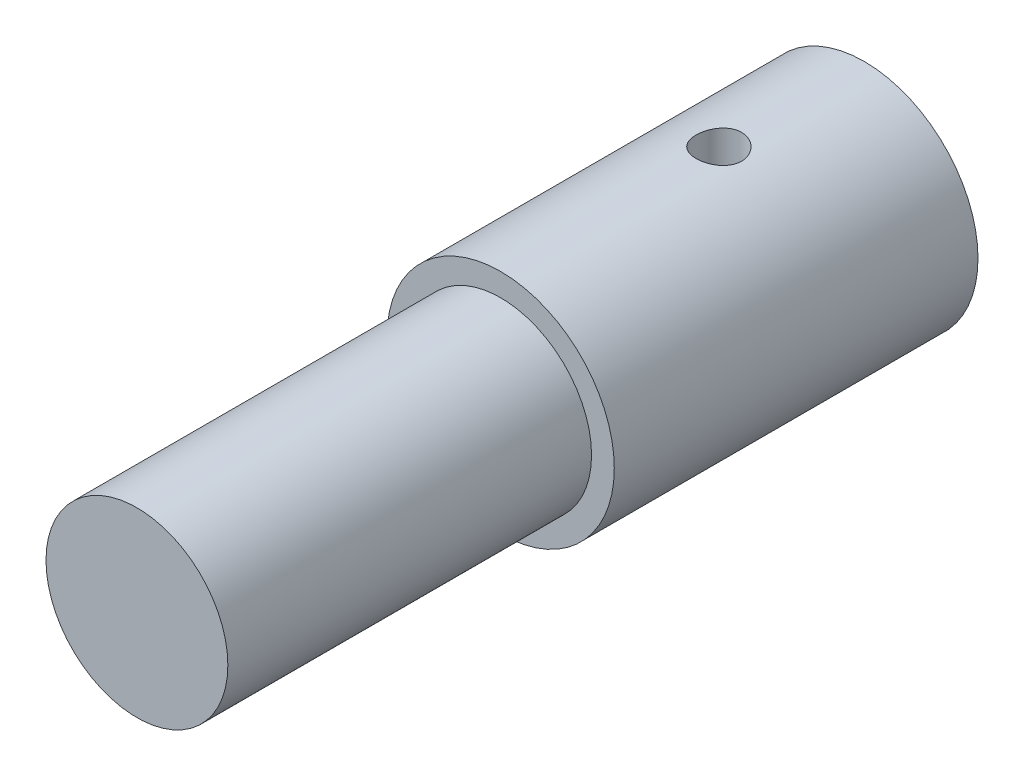
ISO-10303-21;
HEADER;
FILE_DESCRIPTION(('STEP AP214'),'2;1');
FILE_NAME('part.step','',(''),(''),'','','');
FILE_SCHEMA(('AUTOMOTIVE_DESIGN { 1 0 10303 214 1 1 1 1 }'));
ENDSEC;
DATA;
#1=APPLICATION_CONTEXT('core data for automotive mechanical design processes');
#2=APPLICATION_PROTOCOL_DEFINITION('international standard','automotive_design',2000,#1);
#3=PRODUCT_CONTEXT('',#1,'mechanical');
#4=PRODUCT('Part','Part','',(#3));
#5=PRODUCT_RELATED_PRODUCT_CATEGORY('part','',(#4));
#6=PRODUCT_DEFINITION_FORMATION('','',#4);
#7=PRODUCT_DEFINITION_CONTEXT('part definition',#1,'design');
#8=PRODUCT_DEFINITION('design','',#6,#7);
#9=PRODUCT_DEFINITION_SHAPE('','',#8);
#10=(LENGTH_UNIT() NAMED_UNIT(*) SI_UNIT(.MILLI.,.METRE.));
#11=(NAMED_UNIT(*) PLANE_ANGLE_UNIT() SI_UNIT($,.RADIAN.));
#12=(NAMED_UNIT(*) SI_UNIT($,.STERADIAN.) SOLID_ANGLE_UNIT());
#13=UNCERTAINTY_MEASURE_WITH_UNIT(LENGTH_MEASURE(1.E-05),#10,'distance_accuracy_value','');
#14=(GEOMETRIC_REPRESENTATION_CONTEXT(3) GLOBAL_UNCERTAINTY_ASSIGNED_CONTEXT((#13)) GLOBAL_UNIT_ASSIGNED_CONTEXT((#10,
#11,#12)) REPRESENTATION_CONTEXT('',''));
#15=CARTESIAN_POINT('',(0.,0.,0.));
#16=DIRECTION('',(0.,0.,1.));
#17=DIRECTION('',(1.,0.,0.));
#18=AXIS2_PLACEMENT_3D('',#15,#16,#17);
#19=CARTESIAN_POINT('',(0.,0.,-12.7));
#20=DIRECTION('',(0.,0.,1.));
#21=DIRECTION('',(1.,0.,0.));
#22=AXIS2_PLACEMENT_3D('',#19,#20,#21);
#23=CYLINDRICAL_SURFACE('',#22,3.96875);
#24=CARTESIAN_POINT('',(0.,0.,-12.7));
#25=DIRECTION('',(0.,0.,-1.));
#26=DIRECTION('',(-1.,0.,0.));
#27=AXIS2_PLACEMENT_3D('',#24,#25,#26);
#28=CIRCLE('',#27,3.96875);
#29=CARTESIAN_POINT('',(-3.96875,0.,-12.7));
#30=VERTEX_POINT('',#29);
#31=EDGE_CURVE('E52',#30,#30,#28,.T.);
#32=ORIENTED_EDGE('',*,*,#31,.F.);
#33=EDGE_LOOP('',(#32));
#34=FACE_BOUND('',#33,.T.);
#35=CARTESIAN_POINT('',(0.,0.,0.));
#36=DIRECTION('',(0.,0.,-1.));
#37=DIRECTION('',(-1.,0.,0.));
#38=AXIS2_PLACEMENT_3D('',#35,#36,#37);
#39=CIRCLE('',#38,3.96875);
#40=CARTESIAN_POINT('',(-3.96875,0.,0.));
#41=VERTEX_POINT('',#40);
#42=EDGE_CURVE('E55',#41,#41,#39,.T.);
#43=ORIENTED_EDGE('',*,*,#42,.T.);
#44=EDGE_LOOP('',(#43));
#45=FACE_BOUND('',#44,.T.);
#46=CARTESIAN_POINT('',(0.,3.96875,-8.41375));
#47=CARTESIAN_POINT('',(-0.0441141697666526,3.96874918704816,-8.41374837717944));
#48=CARTESIAN_POINT('',(-0.0882488552849584,3.96800693235221,-8.41005998089443));
#49=CARTESIAN_POINT('',(-0.175270721728159,3.9651175271344,-8.39541556553352));
#50=CARTESIAN_POINT('',(-0.218156883298451,3.96296926051523,-8.3844537727138));
#51=CARTESIAN_POINT('',(-0.301410929802754,3.9575077161464,-8.3556147390635));
#52=CARTESIAN_POINT('',(-0.341781183921925,3.95419555454645,-8.33774412200453));
#53=CARTESIAN_POINT('',(-0.418947591160979,3.94676628440531,-8.29561440353791));
#54=CARTESIAN_POINT('',(-0.455743956966425,3.94264922380842,-8.27135568261178));
#55=CARTESIAN_POINT('',(-0.525219197618673,3.93400093730664,-8.21679007015617));
#56=CARTESIAN_POINT('',(-0.557842698732078,3.92946529244076,-8.18641336790823));
#57=CARTESIAN_POINT('',(-0.617566675557621,3.92052318234242,-8.12062414448908));
#58=CARTESIAN_POINT('',(-0.644666719911524,3.91611672722211,-8.08521123037775));
#59=CARTESIAN_POINT('',(-0.692810204219673,3.90788875688763,-8.00995652179682));
#60=CARTESIAN_POINT('',(-0.713796307724781,3.90407292720926,-7.97007737023664));
#61=CARTESIAN_POINT('',(-0.748748872848119,3.89752100271369,-7.88727005616551));
#62=CARTESIAN_POINT('',(-0.762716027934557,3.89478480123557,-7.84434219534384));
#63=CARTESIAN_POINT('',(-0.783054456783581,3.89074664168937,-7.75725178614809));
#64=CARTESIAN_POINT('',(-0.789522882754779,3.8894263564758,-7.71311279308711));
#65=CARTESIAN_POINT('',(-0.794982001382606,3.88831435204373,-7.62435782929205));
#66=CARTESIAN_POINT('',(-0.79397345865384,3.88852247652599,-7.57974190779589));
#67=CARTESIAN_POINT('',(-0.784585817399568,3.89042712473872,-7.49201036200833));
#68=CARTESIAN_POINT('',(-0.776318091318599,3.89210115706644,-7.44888225928332));
#69=CARTESIAN_POINT('',(-0.752822570919546,3.89671358514501,-7.36463786414874));
#70=CARTESIAN_POINT('',(-0.737594444211165,3.89965204127737,-7.32352166792054));
#71=CARTESIAN_POINT('',(-0.700504047041808,3.90648522184699,-7.24414726102277));
#72=CARTESIAN_POINT('',(-0.67859763254049,3.91038627539628,-7.20591024559197));
#73=CARTESIAN_POINT('',(-0.628803649817063,3.91870103651118,-7.13361313783408));
#74=CARTESIAN_POINT('',(-0.600915394208232,3.92311480296703,-7.09955352624939));
#75=CARTESIAN_POINT('',(-0.539353073057463,3.9320551061041,-7.03593541179981));
#76=CARTESIAN_POINT('',(-0.505583952962378,3.93658224311156,-7.00646889926182));
#77=CARTESIAN_POINT('',(-0.43353436284922,3.94516648667062,-6.9536041344984));
#78=CARTESIAN_POINT('',(-0.39525383498239,3.94922358719373,-6.93020596009822));
#79=CARTESIAN_POINT('',(-0.315165888335143,3.95642060315204,-6.89012503955188));
#80=CARTESIAN_POINT('',(-0.273353069295832,3.95955908023316,-6.87345280941965));
#81=CARTESIAN_POINT('',(-0.187443250056127,3.96455430884112,-6.84739512373189));
#82=CARTESIAN_POINT('',(-0.143346527245007,3.96641121562922,-6.83800878547906));
#83=CARTESIAN_POINT('',(-0.0549111532165507,3.96861245794326,-6.82691956480079));
#84=CARTESIAN_POINT('',(-0.0105888856084261,3.96898157380398,-6.82509079198991));
#85=CARTESIAN_POINT('',(0.0777279165154668,3.96823447469519,-6.82882957553536));
#86=CARTESIAN_POINT('',(0.121722469314761,3.96711834322273,-6.83439671611112));
#87=CARTESIAN_POINT('',(0.207728867582567,3.96354166656364,-6.85266470900052));
#88=CARTESIAN_POINT('',(0.249754983994798,3.96109330020839,-6.86530096687021));
#89=CARTESIAN_POINT('',(0.331091879327861,3.95512569448445,-6.89727791123305));
#90=CARTESIAN_POINT('',(0.370402454549797,3.95160637488792,-6.91661910002474));
#91=CARTESIAN_POINT('',(0.445723306613435,3.94382554779552,-6.96172922695448));
#92=CARTESIAN_POINT('',(0.481687288109549,3.9395554815941,-6.98757395744966));
#93=CARTESIAN_POINT('',(0.54881305267587,3.93076695771219,-7.04485604552078));
#94=CARTESIAN_POINT('',(0.579974320213793,3.92624847343658,-7.07629400270489));
#95=CARTESIAN_POINT('',(0.637095968927002,3.91738884698341,-7.14444322306358));
#96=CARTESIAN_POINT('',(0.662969926318619,3.91305145310185,-7.18122749697569));
#97=CARTESIAN_POINT('',(0.708172177165644,3.90512452238229,-7.25869401807686));
#98=CARTESIAN_POINT('',(0.727500732513803,3.90153495562466,-7.29937610922401));
#99=CARTESIAN_POINT('',(0.75894552425568,3.89554037838854,-7.3832785453812));
#100=CARTESIAN_POINT('',(0.771099152959146,3.89312923804798,-7.42648441771069));
#101=CARTESIAN_POINT('',(0.787962492229086,3.8897515295367,-7.51437842870841));
#102=CARTESIAN_POINT('',(0.792673173528682,3.8887847729857,-7.55906637330367));
#103=CARTESIAN_POINT('',(0.794480973001052,3.88841575019907,-7.64778828623205));
#104=CARTESIAN_POINT('',(0.791714656781273,3.88898542106508,-7.69181941196081));
#105=CARTESIAN_POINT('',(0.778948391379423,3.89156236453412,-7.77877512211211));
#106=CARTESIAN_POINT('',(0.76894850030263,3.89356962558941,-7.82169971542025));
#107=CARTESIAN_POINT('',(0.742059863746044,3.89878303473957,-7.90513699579718));
#108=CARTESIAN_POINT('',(0.725187864706891,3.90198626683697,-7.94565527364879));
#109=CARTESIAN_POINT('',(0.685049624152523,3.90923236260748,-8.02330732833296));
#110=CARTESIAN_POINT('',(0.661782846465062,3.91327529667872,-8.06044082101933));
#111=CARTESIAN_POINT('',(0.609049069861716,3.9218311241531,-8.13094923539431));
#112=CARTESIAN_POINT('',(0.579483447992924,3.92635083497074,-8.16424958243115));
#113=CARTESIAN_POINT('',(0.515194842904181,3.93530202485864,-8.22546155063878));
#114=CARTESIAN_POINT('',(0.48047067605296,3.93973348341403,-8.25337193168933));
#115=CARTESIAN_POINT('',(0.406413993088796,3.94806354457952,-8.30328749863249));
#116=CARTESIAN_POINT('',(0.367037052016182,3.95195608530277,-8.32522782760352));
#117=CARTESIAN_POINT('',(0.285088298996706,3.95871005536219,-8.36214523481105));
#118=CARTESIAN_POINT('',(0.242519407060106,3.96157241353776,-8.37712858919141));
#119=CARTESIAN_POINT('',(0.166545806833249,3.96538745747575,-8.39680498376049));
#120=CARTESIAN_POINT('',(0.133573570810941,3.96664103132021,-8.40314803500553));
#121=CARTESIAN_POINT('',(0.0670714981354904,3.9683225984854,-8.41162109293445));
#122=CARTESIAN_POINT('',(0.0335416792879663,3.96875061811817,-8.41375123389213));
#123=CARTESIAN_POINT('',(0.,3.96875,-8.41375));
#124=B_SPLINE_CURVE_WITH_KNOTS('',3,(#46,#47,#48,#49,#50,#51,#52,#53,#54,#55,#56,#57,#58,#59,
#60,#61,#62,#63,#64,#65,#66,#67,#68,#69,#70,#71,#72,#73,#74,#75,#76,#77,#78,#79,#80,#81,#82,#83,
#84,#85,#86,#87,#88,#89,#90,#91,#92,#93,#94,#95,#96,#97,#98,#99,#100,#101,#102,#103,#104,#105,
#106,#107,#108,#109,#110,#111,#112,#113,#114,#115,#116,#117,#118,#119,#120,#121,#122,#123),
.UNSPECIFIED.,.T.,.F.,(4,2,2,2,2,2,2,2,2,2,2,2,2,2,2,2,2,2,2,2,2,2,2,2,2,2,2,2,2,2,2,2,2,2,2,2,
2,2,4),(0.,0.132219803712374,0.264544691486237,0.396743027354958,0.528933491145748,
0.662727806901547,0.796532567418222,0.931554485359512,1.06656306058625,1.19980221925972,
1.33302775273222,1.46424433311233,1.59546718032648,1.72757695349102,1.85970191582551,
1.99420362915009,2.12870706734732,2.26341999415381,2.39811659772816,2.53056021443035,
2.66299638578432,2.79424172823387,2.92549690502718,3.05835896163978,3.19123526999582,
3.3261349893476,3.46102931049251,3.59521427444724,3.72938173612266,3.86111529788113,
3.99284780147258,4.12426119244656,4.25568560518106,4.38934285514819,4.52303082035513,
4.65811787986286,4.7930828344203,4.89361777886353,4.99414951900728),.UNSPECIFIED.);
#125=CARTESIAN_POINT('',(0.,3.96875,-8.41375));
#126=VERTEX_POINT('',#125);
#127=EDGE_CURVE('E64',#126,#126,#124,.T.);
#128=ORIENTED_EDGE('',*,*,#127,.F.);
#129=EDGE_LOOP('',(#128));
#130=FACE_BOUND('',#129,.T.);
#131=ADVANCED_FACE('F35',(#34,#45,#130),#23,.T.);
#132=CARTESIAN_POINT('',(0.,0.,-3.81));
#133=DIRECTION('',(0.,0.,-1.));
#134=DIRECTION('',(-1.,0.,0.));
#135=AXIS2_PLACEMENT_3D('',#132,#133,#134);
#136=CYLINDRICAL_SURFACE('',#135,1.5875);
#137=CARTESIAN_POINT('',(0.,0.,-12.7));
#138=DIRECTION('',(0.,0.,-1.));
#139=DIRECTION('',(-1.,0.,0.));
#140=AXIS2_PLACEMENT_3D('',#137,#138,#139);
#141=CIRCLE('',#140,1.5875);
#142=CARTESIAN_POINT('',(-1.5875,0.,-12.7));
#143=VERTEX_POINT('',#142);
#144=EDGE_CURVE('E61',#143,#143,#141,.T.);
#145=ORIENTED_EDGE('',*,*,#144,.T.);
#146=EDGE_LOOP('',(#145));
#147=FACE_BOUND('',#146,.T.);
#148=CARTESIAN_POINT('',(0.,0.,-3.81));
#149=DIRECTION('',(0.,0.,-1.));
#150=DIRECTION('',(-1.,0.,0.));
#151=AXIS2_PLACEMENT_3D('',#148,#149,#150);
#152=CIRCLE('',#151,1.5875);
#153=CARTESIAN_POINT('',(-1.5875,0.,-3.81));
#154=VERTEX_POINT('',#153);
#155=EDGE_CURVE('E58',#154,#154,#152,.T.);
#156=ORIENTED_EDGE('',*,*,#155,.F.);
#157=EDGE_LOOP('',(#156));
#158=FACE_BOUND('',#157,.T.);
#159=CARTESIAN_POINT('',(0.,1.5875,-8.41375));
#160=CARTESIAN_POINT('',(0.041728995593933,1.58749772514545,-8.4137473787839));
#161=CARTESIAN_POINT('',(0.0835077385103133,1.58583702246742,-8.41044000445967));
#162=CARTESIAN_POINT('',(0.165830436744312,1.57935736354683,-8.3973567762294));
#163=CARTESIAN_POINT('',(0.206371893828843,1.57453240964256,-8.38756863805811));
#164=CARTESIAN_POINT('',(0.284903501248956,1.56222921776379,-8.36200241441042));
#165=CARTESIAN_POINT('',(0.322902899832974,1.55476129847157,-8.34624760750314));
#166=CARTESIAN_POINT('',(0.395662639590211,1.53785710109399,-8.30931581929158));
#167=CARTESIAN_POINT('',(0.430423235854602,1.52842097821614,-8.28813926550247));
#168=CARTESIAN_POINT('',(0.498084330348523,1.50777779992333,-8.23950818322104));
#169=CARTESIAN_POINT('',(0.530745073828176,1.49649814307482,-8.21175135710353));
#170=CARTESIAN_POINT('',(0.591168684363163,1.47367601383353,-8.15139857584767));
#171=CARTESIAN_POINT('',(0.618927819090995,1.46213334865922,-8.11879896765562));
#172=CARTESIAN_POINT('',(0.670918775357408,1.43906042512894,-8.04665384131581));
#173=CARTESIAN_POINT('',(0.694710110094112,1.42760054657542,-8.00676572193793));
#174=CARTESIAN_POINT('',(0.735146030094489,1.40720745650529,-7.92292092706094));
#175=CARTESIAN_POINT('',(0.751795720629527,1.39827244163048,-7.87896718532632));
#176=CARTESIAN_POINT('',(0.776392625987191,1.38475931961261,-7.79092207257135));
#177=CARTESIAN_POINT('',(0.7848011490576,1.37995240569573,-7.74699646617151));
#178=CARTESIAN_POINT('',(0.794088925938896,1.37463125146644,-7.65811679751254));
#179=CARTESIAN_POINT('',(0.794975620146127,1.37411276916235,-7.61316379568352));
#180=CARTESIAN_POINT('',(0.789533034193008,1.37724300891691,-7.52928546819968));
#181=CARTESIAN_POINT('',(0.784053994132351,1.38040081156723,-7.4902821752167));
#182=CARTESIAN_POINT('',(0.767508505188939,1.38966756557494,-7.41384573443515));
#183=CARTESIAN_POINT('',(0.75644027646876,1.39577745697722,-7.37641309091391));
#184=CARTESIAN_POINT('',(0.72882901318139,1.41039434402613,-7.30311187602601));
#185=CARTESIAN_POINT('',(0.71216445952332,1.41895386027049,-7.26730004596378));
#186=CARTESIAN_POINT('',(0.673926839586476,1.43750827148364,-7.19880903025668));
#187=CARTESIAN_POINT('',(0.652351568526146,1.44750381044276,-7.16613126111743));
#188=CARTESIAN_POINT('',(0.601714931087025,1.46933569085733,-7.10047375563506));
#189=CARTESIAN_POINT('',(0.572051226330617,1.48124473750417,-7.06798110659893));
#190=CARTESIAN_POINT('',(0.507647240625965,1.50453425994698,-7.00822876149347));
#191=CARTESIAN_POINT('',(0.472904547405839,1.51591448117298,-6.98097156632311));
#192=CARTESIAN_POINT('',(0.39728497650403,1.53750952405853,-6.93127450655765));
#193=CARTESIAN_POINT('',(0.35619816333203,1.54764568678593,-6.90911712499619));
#194=CARTESIAN_POINT('',(0.270245058544232,1.56494068139986,-6.87221048319711));
#195=CARTESIAN_POINT('',(0.225381801160563,1.57210187661445,-6.85745534064421));
#196=CARTESIAN_POINT('',(0.137133402755682,1.58213689907265,-6.83698514829989));
#197=CARTESIAN_POINT('',(0.0939335898727321,1.58531669776666,-6.830622581626));
#198=CARTESIAN_POINT('',(0.00696880745979929,1.58807954433162,-6.825087369662));
#199=CARTESIAN_POINT('',(-0.0367958845217344,1.58766429610042,-6.82591131827366));
#200=CARTESIAN_POINT('',(-0.120041171513883,1.58346133851169,-6.83435155893239));
#201=CARTESIAN_POINT('',(-0.159590905139651,1.57993751265001,-6.84143644785446));
#202=CARTESIAN_POINT('',(-0.236860470764647,1.57021348481138,-6.86136396956672));
#203=CARTESIAN_POINT('',(-0.274580100517229,1.56401298777876,-6.87420723712235));
#204=CARTESIAN_POINT('',(-0.348367832956922,1.549274995596,-6.90562378273133));
#205=CARTESIAN_POINT('',(-0.384357877623634,1.54067574904889,-6.92435039603022));
#206=CARTESIAN_POINT('',(-0.452803705848519,1.52196779614205,-6.96682910641905));
#207=CARTESIAN_POINT('',(-0.48525797488413,1.51185844730342,-6.99058334433354));
#208=CARTESIAN_POINT('',(-0.549090603374456,1.48993400686612,-7.04513483760797));
#209=CARTESIAN_POINT('',(-0.580050336773307,1.4780488984845,-7.07639465183502));
#210=CARTESIAN_POINT('',(-0.636473454883634,1.45464523335575,-7.14369058882001));
#211=CARTESIAN_POINT('',(-0.661933037392105,1.44312693484087,-7.1797299880605));
#212=CARTESIAN_POINT('',(-0.707793157132546,1.42121883829442,-7.2577671505215));
#213=CARTESIAN_POINT('',(-0.727888987353668,1.41091070420381,-7.29996894255307));
#214=CARTESIAN_POINT('',(-0.760478243148456,1.393619199422,-7.38783611623094));
#215=CARTESIAN_POINT('',(-0.772981464485758,1.38663154728491,-7.43349694916032));
#216=CARTESIAN_POINT('',(-0.788877714413182,1.37764441425629,-7.52229748939628));
#217=CARTESIAN_POINT('',(-0.793030065893186,1.37523048121765,-7.5652584386593));
#218=CARTESIAN_POINT('',(-0.794297016289749,1.37450000250401,-7.65131110956677));
#219=CARTESIAN_POINT('',(-0.791414665758116,1.3761816807937,-7.69440276643693));
#220=CARTESIAN_POINT('',(-0.779403862188858,1.38301303002207,-7.77516502934104));
#221=CARTESIAN_POINT('',(-0.770896599509597,1.387817062454,-7.81296099817712));
#222=CARTESIAN_POINT('',(-0.748645440590812,1.39994494099159,-7.88654769479336));
#223=CARTESIAN_POINT('',(-0.734899859858099,1.4072695975843,-7.9223377732855));
#224=CARTESIAN_POINT('',(-0.701528747832417,1.42421395976844,-7.99355847547062));
#225=CARTESIAN_POINT('',(-0.681570215641813,1.43395479651976,-8.02880339707732));
#226=CARTESIAN_POINT('',(-0.636707333736578,1.45443044484956,-8.09567416309334));
#227=CARTESIAN_POINT('',(-0.611800410920677,1.46516577199402,-8.12729811109905));
#228=CARTESIAN_POINT('',(-0.554198890540059,1.48798219007705,-8.19002519849636));
#229=CARTESIAN_POINT('',(-0.520925760764323,1.50006830503478,-8.22059816249978));
#230=CARTESIAN_POINT('',(-0.449385377437346,1.52302965852476,-8.27584624309251));
#231=CARTESIAN_POINT('',(-0.411115449085073,1.53390424270132,-8.30051818066962));
#232=CARTESIAN_POINT('',(-0.330145704975832,1.55335295108176,-8.3432938629425));
#233=CARTESIAN_POINT('',(-0.2874164812481,1.56191026646809,-8.36134993447032));
#234=CARTESIAN_POINT('',(-0.199026542902264,1.57560439707251,-8.38978523328567));
#235=CARTESIAN_POINT('',(-0.153374565950888,1.58075092927265,-8.40018627842098));
#236=CARTESIAN_POINT('',(-0.0893777950211856,1.58508272890795,-8.40890607004146));
#237=CARTESIAN_POINT('',(-0.0715659918051021,1.58598683737991,-8.4107199711855));
#238=CARTESIAN_POINT('',(-0.0358391871219315,1.5871959697618,-8.41314251575396));
#239=CARTESIAN_POINT('',(-0.0179241828201091,1.58750097713612,-8.41375112591151));
#240=CARTESIAN_POINT('',(0.,1.5875,-8.41375));
#241=B_SPLINE_CURVE_WITH_KNOTS('',3,(#159,#160,#161,#162,#163,#164,#165,#166,#167,#168,#169,
#170,#171,#172,#173,#174,#175,#176,#177,#178,#179,#180,#181,#182,#183,#184,#185,#186,#187,#188,
#189,#190,#191,#192,#193,#194,#195,#196,#197,#198,#199,#200,#201,#202,#203,#204,#205,#206,#207,
#208,#209,#210,#211,#212,#213,#214,#215,#216,#217,#218,#219,#220,#221,#222,#223,#224,#225,#226,
#227,#228,#229,#230,#231,#232,#233,#234,#235,#236,#237,#238,#239,#240),.UNSPECIFIED.,.T.,.F.,(4,
2,2,2,2,2,2,2,2,2,2,2,2,2,2,2,2,2,2,2,2,2,2,2,2,2,2,2,2,2,2,2,2,2,2,2,2,2,2,2,4),(0.,
0.125114254327357,0.250466343831675,0.375334335922011,0.500192484961619,0.632604270982483,
0.76511645113789,0.907904953544099,1.0505912114426,1.18473547136307,1.3187470237991,
1.43673284224898,1.55475625616007,1.67552878133737,1.79635563750301,1.93250297183766,
2.06871518087707,2.21125273882712,2.35367684674122,2.4843048681163,2.61487098080984,
2.73531732039234,2.85577694044552,2.97968079472144,3.10363751531494,3.23976690949007,
3.37599010963499,3.51881028964241,3.66144581352992,3.79038887826834,3.91927603763879,
4.0358848213132,4.15253113472044,4.27701437565643,4.40156251654047,4.54124411434795,
4.68100079305154,4.82174560844946,4.96208771221038,5.01582753609297,5.06956884321159),.UNSPECIFIED.);
#242=CARTESIAN_POINT('',(0.,1.5875,-8.41375));
#243=VERTEX_POINT('',#242);
#244=EDGE_CURVE('E39',#243,#243,#241,.T.);
#245=ORIENTED_EDGE('',*,*,#244,.F.);
#246=EDGE_LOOP('',(#245));
#247=FACE_BOUND('',#246,.T.);
#248=ADVANCED_FACE('F83',(#147,#158,#247),#136,.F.);
#249=CARTESIAN_POINT('',(0.,0.,12.7));
#250=DIRECTION('',(0.,0.,-1.));
#251=DIRECTION('',(-1.,0.,0.));
#252=AXIS2_PLACEMENT_3D('',#249,#250,#251);
#253=CYLINDRICAL_SURFACE('',#252,3.175);
#254=CARTESIAN_POINT('',(0.,0.,12.7));
#255=DIRECTION('',(0.,0.,1.));
#256=DIRECTION('',(1.,0.,0.));
#257=AXIS2_PLACEMENT_3D('',#254,#255,#256);
#258=CIRCLE('',#257,3.175);
#259=CARTESIAN_POINT('',(3.175,0.,12.7));
#260=VERTEX_POINT('',#259);
#261=EDGE_CURVE('E10',#260,#260,#258,.T.);
#262=ORIENTED_EDGE('',*,*,#261,.F.);
#263=EDGE_LOOP('',(#262));
#264=FACE_BOUND('',#263,.T.);
#265=CARTESIAN_POINT('',(0.,0.,0.));
#266=DIRECTION('',(0.,0.,-1.));
#267=DIRECTION('',(-1.,0.,0.));
#268=AXIS2_PLACEMENT_3D('',#265,#266,#267);
#269=CIRCLE('',#268,3.175);
#270=CARTESIAN_POINT('',(-3.175,0.,0.));
#271=VERTEX_POINT('',#270);
#272=EDGE_CURVE('E47',#271,#271,#269,.T.);
#273=ORIENTED_EDGE('',*,*,#272,.F.);
#274=EDGE_LOOP('',(#273));
#275=FACE_BOUND('',#274,.T.);
#276=ADVANCED_FACE('F37',(#264,#275),#253,.T.);
#277=CARTESIAN_POINT('',(0.,0.,12.7));
#278=DIRECTION('',(0.,0.,1.));
#279=DIRECTION('',(1.,0.,0.));
#280=AXIS2_PLACEMENT_3D('',#277,#278,#279);
#281=PLANE('',#280);
#282=ORIENTED_EDGE('',*,*,#261,.T.);
#283=EDGE_LOOP('',(#282));
#284=FACE_BOUND('',#283,.T.);
#285=ADVANCED_FACE('F92',(#284),#281,.T.);
#286=CARTESIAN_POINT('',(0.,0.,0.));
#287=DIRECTION('',(0.,0.,-1.));
#288=DIRECTION('',(-1.,0.,0.));
#289=AXIS2_PLACEMENT_3D('',#286,#287,#288);
#290=PLANE('',#289);
#291=ORIENTED_EDGE('',*,*,#42,.F.);
#292=EDGE_LOOP('',(#291));
#293=FACE_BOUND('',#292,.T.);
#294=ORIENTED_EDGE('',*,*,#272,.T.);
#295=EDGE_LOOP('',(#294));
#296=FACE_BOUND('',#295,.T.);
#297=ADVANCED_FACE('F89',(#293,#296),#290,.F.);
#298=CARTESIAN_POINT('',(0.,0.,-12.7));
#299=DIRECTION('',(0.,0.,-1.));
#300=DIRECTION('',(-1.,0.,0.));
#301=AXIS2_PLACEMENT_3D('',#298,#299,#300);
#302=PLANE('',#301);
#303=ORIENTED_EDGE('',*,*,#144,.F.);
#304=EDGE_LOOP('',(#303));
#305=FACE_BOUND('',#304,.T.);
#306=ORIENTED_EDGE('',*,*,#31,.T.);
#307=EDGE_LOOP('',(#306));
#308=FACE_BOUND('',#307,.T.);
#309=ADVANCED_FACE('F81',(#305,#308),#302,.T.);
#310=CARTESIAN_POINT('',(0.,0.,-3.81));
#311=DIRECTION('',(0.,0.,-1.));
#312=DIRECTION('',(-1.,0.,0.));
#313=AXIS2_PLACEMENT_3D('',#310,#311,#312);
#314=PLANE('',#313);
#315=ORIENTED_EDGE('',*,*,#155,.T.);
#316=EDGE_LOOP('',(#315));
#317=FACE_BOUND('',#316,.T.);
#318=ADVANCED_FACE('F77',(#317),#314,.T.);
#319=CARTESIAN_POINT('',(0.,3.96875,-7.62));
#320=DIRECTION('',(0.,-1.,0.));
#321=DIRECTION('',(0.,0.,-1.));
#322=AXIS2_PLACEMENT_3D('',#319,#320,#321);
#323=CYLINDRICAL_SURFACE('',#322,0.793749999999999);
#324=ORIENTED_EDGE('',*,*,#244,.T.);
#325=EDGE_LOOP('',(#324));
#326=FACE_BOUND('',#325,.T.);
#327=ORIENTED_EDGE('',*,*,#127,.T.);
#328=EDGE_LOOP('',(#327));
#329=FACE_BOUND('',#328,.T.);
#330=ADVANCED_FACE('F73',(#326,#329),#323,.F.);
#331=CLOSED_SHELL('',(#131,#248,#276,#285,#297,#309,#318,#330));
#332=MANIFOLD_SOLID_BREP('B2',#331);
#333=ADVANCED_BREP_SHAPE_REPRESENTATION('',(#18,#332),#14);
#334=SHAPE_DEFINITION_REPRESENTATION(#9,#333);
ENDSEC;
END-ISO-10303-21;
